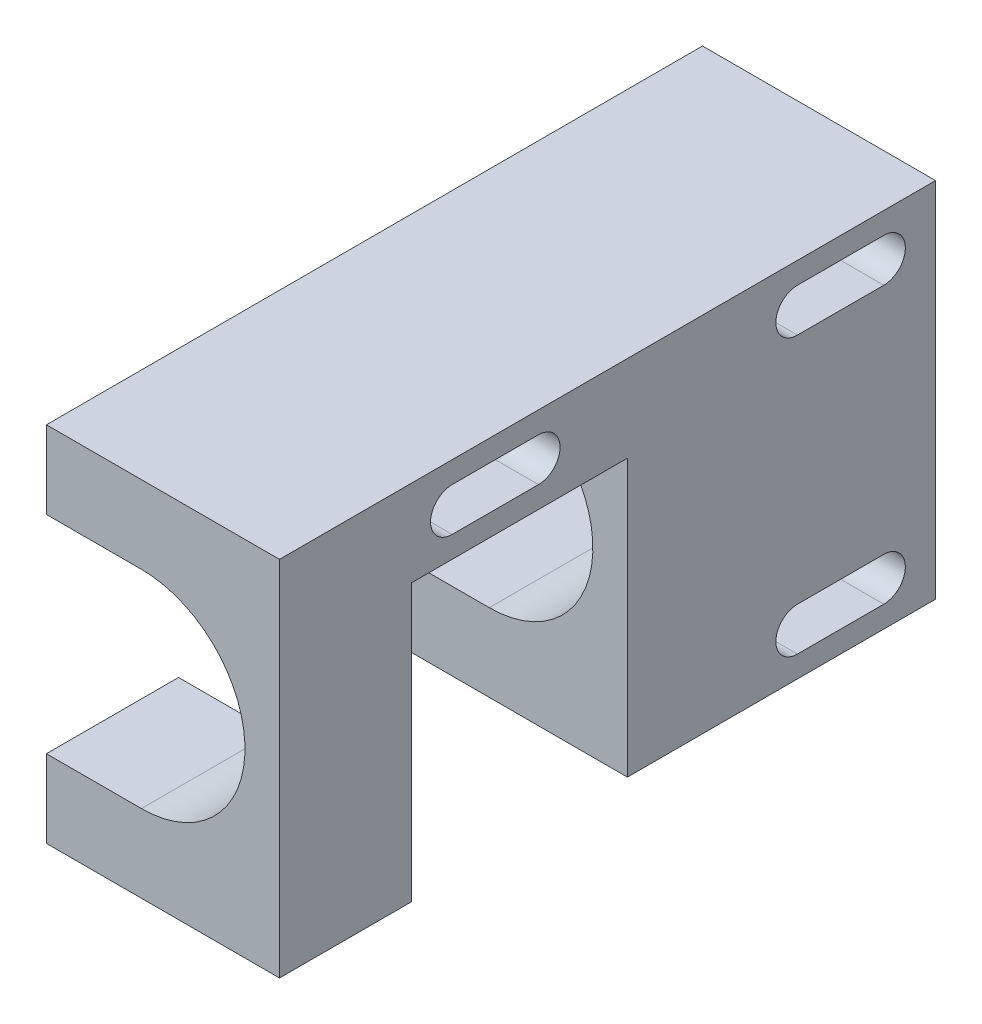
ISO-10303-21;
HEADER;
FILE_DESCRIPTION(('STEP AP214'),'2;1');
FILE_NAME('part.step','',(''),(''),'','','');
FILE_SCHEMA(('AUTOMOTIVE_DESIGN { 1 0 10303 214 1 1 1 1 }'));
ENDSEC;
DATA;
#1=APPLICATION_CONTEXT('core data for automotive mechanical design processes');
#2=APPLICATION_PROTOCOL_DEFINITION('international standard','automotive_design',2000,#1);
#3=PRODUCT_CONTEXT('',#1,'mechanical');
#4=PRODUCT('Part','Part','',(#3));
#5=PRODUCT_RELATED_PRODUCT_CATEGORY('part','',(#4));
#6=PRODUCT_DEFINITION_FORMATION('','',#4);
#7=PRODUCT_DEFINITION_CONTEXT('part definition',#1,'design');
#8=PRODUCT_DEFINITION('design','',#6,#7);
#9=PRODUCT_DEFINITION_SHAPE('','',#8);
#10=(LENGTH_UNIT() NAMED_UNIT(*) SI_UNIT(.MILLI.,.METRE.));
#11=(NAMED_UNIT(*) PLANE_ANGLE_UNIT() SI_UNIT($,.RADIAN.));
#12=(NAMED_UNIT(*) SI_UNIT($,.STERADIAN.) SOLID_ANGLE_UNIT());
#13=UNCERTAINTY_MEASURE_WITH_UNIT(LENGTH_MEASURE(1.E-05),#10,'distance_accuracy_value','');
#14=(GEOMETRIC_REPRESENTATION_CONTEXT(3) GLOBAL_UNCERTAINTY_ASSIGNED_CONTEXT((#13)) GLOBAL_UNIT_ASSIGNED_CONTEXT((#10,
#11,#12)) REPRESENTATION_CONTEXT('',''));
#15=CARTESIAN_POINT('',(0.,0.,0.));
#16=DIRECTION('',(0.,0.,1.));
#17=DIRECTION('',(1.,0.,0.));
#18=AXIS2_PLACEMENT_3D('',#15,#16,#17);
#19=CARTESIAN_POINT('',(0.,0.,76.));
#20=DIRECTION('',(-1.,0.,0.));
#21=DIRECTION('',(0.,-1.,0.));
#22=AXIS2_PLACEMENT_3D('',#19,#20,#21);
#23=PLANE('',#22);
#24=DIRECTION('',(0.,-1.,0.));
#25=VECTOR('',#24,1.);
#26=CARTESIAN_POINT('',(0.,0.,35.7));
#27=LINE('',#26,#25);
#28=CARTESIAN_POINT('',(0.,9.,35.7));
#29=VERTEX_POINT('',#28);
#30=CARTESIAN_POINT('',(0.,0.,35.7));
#31=VERTEX_POINT('',#30);
#32=EDGE_CURVE('E218',#29,#31,#27,.T.);
#33=ORIENTED_EDGE('',*,*,#32,.F.);
#34=DIRECTION('',(0.,0.,-1.));
#35=VECTOR('',#34,1.);
#36=CARTESIAN_POINT('',(0.,9.,76.));
#37=LINE('',#36,#35);
#38=CARTESIAN_POINT('',(0.,9.,0.));
#39=VERTEX_POINT('',#38);
#40=EDGE_CURVE('E273',#29,#39,#37,.T.);
#41=ORIENTED_EDGE('',*,*,#40,.T.);
#42=DIRECTION('',(0.,-1.,0.));
#43=VECTOR('',#42,1.);
#44=CARTESIAN_POINT('',(0.,0.,0.));
#45=LINE('',#44,#43);
#46=CARTESIAN_POINT('',(0.,0.,0.));
#47=VERTEX_POINT('',#46);
#48=EDGE_CURVE('E391',#39,#47,#45,.T.);
#49=ORIENTED_EDGE('',*,*,#48,.T.);
#50=DIRECTION('',(0.,0.,-1.));
#51=VECTOR('',#50,1.);
#52=CARTESIAN_POINT('',(0.,0.,76.));
#53=LINE('',#52,#51);
#54=EDGE_CURVE('E227',#31,#47,#53,.T.);
#55=ORIENTED_EDGE('',*,*,#54,.F.);
#56=EDGE_LOOP('',(#33,#41,#49,#55));
#57=FACE_BOUND('',#56,.T.);
#58=CARTESIAN_POINT('',(0.,5.,16.));
#59=DIRECTION('',(1.,0.,0.));
#60=DIRECTION('',(0.,-1.,0.));
#61=AXIS2_PLACEMENT_3D('',#58,#59,#60);
#62=CIRCLE('',#61,2.49999999999999);
#63=CARTESIAN_POINT('',(0.,7.49999999999999,16.));
#64=VERTEX_POINT('',#63);
#65=CARTESIAN_POINT('',(0.,2.50000000000001,16.));
#66=VERTEX_POINT('',#65);
#67=EDGE_CURVE('E270',#64,#66,#62,.T.);
#68=ORIENTED_EDGE('',*,*,#67,.T.);
#69=DIRECTION('',(0.,0.,-1.));
#70=VECTOR('',#69,1.);
#71=CARTESIAN_POINT('',(0.,2.50000000000001,16.));
#72=LINE('',#71,#70);
#73=CARTESIAN_POINT('',(0.,2.50000000000001,6.));
#74=VERTEX_POINT('',#73);
#75=EDGE_CURVE('E360',#66,#74,#72,.T.);
#76=ORIENTED_EDGE('',*,*,#75,.T.);
#77=CARTESIAN_POINT('',(0.,5.,6.));
#78=DIRECTION('',(1.,0.,0.));
#79=DIRECTION('',(0.,-1.,0.));
#80=AXIS2_PLACEMENT_3D('',#77,#78,#79);
#81=CIRCLE('',#80,2.49999999999999);
#82=CARTESIAN_POINT('',(0.,7.49999999999999,6.));
#83=VERTEX_POINT('',#82);
#84=EDGE_CURVE('E363',#74,#83,#81,.T.);
#85=ORIENTED_EDGE('',*,*,#84,.T.);
#86=DIRECTION('',(0.,0.,1.));
#87=VECTOR('',#86,1.);
#88=CARTESIAN_POINT('',(0.,7.49999999999999,16.));
#89=LINE('',#88,#87);
#90=EDGE_CURVE('E348',#83,#64,#89,.T.);
#91=ORIENTED_EDGE('',*,*,#90,.T.);
#92=EDGE_LOOP('',(#68,#76,#85,#91));
#93=FACE_BOUND('',#92,.T.);
#94=ADVANCED_FACE('F35',(#57,#93),#23,.T.);
#95=CARTESIAN_POINT('',(27.,0.,76.));
#96=DIRECTION('',(0.,-1.,0.));
#97=DIRECTION('',(0.,0.,1.));
#98=AXIS2_PLACEMENT_3D('',#95,#96,#97);
#99=PLANE('',#98);
#100=DIRECTION('',(1.,0.,0.));
#101=VECTOR('',#100,1.);
#102=CARTESIAN_POINT('',(0.,0.,35.7));
#103=LINE('',#102,#101);
#104=CARTESIAN_POINT('',(27.,0.,35.7));
#105=VERTEX_POINT('',#104);
#106=EDGE_CURVE('E243',#31,#105,#103,.T.);
#107=ORIENTED_EDGE('',*,*,#106,.F.);
#108=ORIENTED_EDGE('',*,*,#54,.T.);
#109=DIRECTION('',(1.,0.,0.));
#110=VECTOR('',#109,1.);
#111=CARTESIAN_POINT('',(27.,0.,0.));
#112=LINE('',#111,#110);
#113=CARTESIAN_POINT('',(27.,0.,0.));
#114=VERTEX_POINT('',#113);
#115=EDGE_CURVE('E306',#47,#114,#112,.T.);
#116=ORIENTED_EDGE('',*,*,#115,.T.);
#117=DIRECTION('',(0.,0.,-1.));
#118=VECTOR('',#117,1.);
#119=CARTESIAN_POINT('',(27.,0.,76.));
#120=LINE('',#119,#118);
#121=EDGE_CURVE('E384',#105,#114,#120,.T.);
#122=ORIENTED_EDGE('',*,*,#121,.F.);
#123=EDGE_LOOP('',(#107,#108,#116,#122));
#124=FACE_BOUND('',#123,.T.);
#125=ADVANCED_FACE('F420',(#124),#99,.T.);
#126=CARTESIAN_POINT('',(0.,9.,76.));
#127=DIRECTION('',(0.,-1.,0.));
#128=DIRECTION('',(0.,0.,1.));
#129=AXIS2_PLACEMENT_3D('',#126,#127,#128);
#130=PLANE('',#129);
#131=DIRECTION('',(0.,0.,-1.));
#132=VECTOR('',#131,1.);
#133=CARTESIAN_POINT('',(11.,9.,76.));
#134=LINE('',#133,#132);
#135=CARTESIAN_POINT('',(11.,9.,35.7));
#136=VERTEX_POINT('',#135);
#137=CARTESIAN_POINT('',(11.,9.,0.));
#138=VERTEX_POINT('',#137);
#139=EDGE_CURVE('E271',#136,#138,#134,.T.);
#140=ORIENTED_EDGE('',*,*,#139,.T.);
#141=DIRECTION('',(1.,0.,0.));
#142=VECTOR('',#141,1.);
#143=CARTESIAN_POINT('',(0.,9.,0.));
#144=LINE('',#143,#142);
#145=EDGE_CURVE('E257',#39,#138,#144,.T.);
#146=ORIENTED_EDGE('',*,*,#145,.F.);
#147=ORIENTED_EDGE('',*,*,#40,.F.);
#148=DIRECTION('',(-1.,0.,0.));
#149=VECTOR('',#148,1.);
#150=CARTESIAN_POINT('',(0.,9.,35.7));
#151=LINE('',#150,#149);
#152=EDGE_CURVE('E43',#136,#29,#151,.T.);
#153=ORIENTED_EDGE('',*,*,#152,.F.);
#154=EDGE_LOOP('',(#140,#146,#147,#153));
#155=FACE_BOUND('',#154,.T.);
#156=ADVANCED_FACE('F412',(#155),#130,.F.);
#157=DIRECTION('',(0.,1.,0.));
#158=VECTOR('',#157,1.);
#159=CARTESIAN_POINT('',(0.,32.,60.7));
#160=LINE('',#159,#158);
#161=CARTESIAN_POINT('',(0.,0.,60.7));
#162=VERTEX_POINT('',#161);
#163=CARTESIAN_POINT('',(0.,9.,60.7));
#164=VERTEX_POINT('',#163);
#165=EDGE_CURVE('E211',#162,#164,#160,.T.);
#166=ORIENTED_EDGE('',*,*,#165,.F.);
#167=CARTESIAN_POINT('',(0.,0.,76.));
#168=VERTEX_POINT('',#167);
#169=EDGE_CURVE('E221',#168,#162,#53,.T.);
#170=ORIENTED_EDGE('',*,*,#169,.F.);
#171=DIRECTION('',(0.,-1.,0.));
#172=VECTOR('',#171,1.);
#173=CARTESIAN_POINT('',(0.,0.,76.));
#174=LINE('',#173,#172);
#175=CARTESIAN_POINT('',(0.,9.,76.));
#176=VERTEX_POINT('',#175);
#177=EDGE_CURVE('E380',#176,#168,#174,.T.);
#178=ORIENTED_EDGE('',*,*,#177,.F.);
#179=EDGE_CURVE('E232',#176,#164,#37,.T.);
#180=ORIENTED_EDGE('',*,*,#179,.T.);
#181=EDGE_LOOP('',(#166,#170,#178,#180));
#182=FACE_BOUND('',#181,.T.);
#183=ADVANCED_FACE('F230',(#182),#23,.T.);
#184=DIRECTION('',(1.,0.,0.));
#185=VECTOR('',#184,1.);
#186=CARTESIAN_POINT('',(0.,0.,60.7));
#187=LINE('',#186,#185);
#188=CARTESIAN_POINT('',(27.,0.,60.7));
#189=VERTEX_POINT('',#188);
#190=EDGE_CURVE('E207',#162,#189,#187,.T.);
#191=ORIENTED_EDGE('',*,*,#190,.T.);
#192=CARTESIAN_POINT('',(27.,0.,76.));
#193=VERTEX_POINT('',#192);
#194=EDGE_CURVE('E400',#193,#189,#120,.T.);
#195=ORIENTED_EDGE('',*,*,#194,.F.);
#196=DIRECTION('',(1.,0.,0.));
#197=VECTOR('',#196,1.);
#198=CARTESIAN_POINT('',(27.,0.,76.));
#199=LINE('',#198,#197);
#200=EDGE_CURVE('E223',#168,#193,#199,.T.);
#201=ORIENTED_EDGE('',*,*,#200,.F.);
#202=ORIENTED_EDGE('',*,*,#169,.T.);
#203=EDGE_LOOP('',(#191,#195,#201,#202));
#204=FACE_BOUND('',#203,.T.);
#205=ADVANCED_FACE('F37',(#204),#99,.T.);
#206=DIRECTION('',(0.,0.,-1.));
#207=VECTOR('',#206,1.);
#208=CARTESIAN_POINT('',(0.,33.,76.));
#209=LINE('',#208,#207);
#210=CARTESIAN_POINT('',(0.,33.,76.));
#211=VERTEX_POINT('',#210);
#212=CARTESIAN_POINT('',(0.,33.,0.));
#213=VERTEX_POINT('',#212);
#214=EDGE_CURVE('E274',#211,#213,#209,.T.);
#215=ORIENTED_EDGE('',*,*,#214,.F.);
#216=CARTESIAN_POINT('',(0.,42.,76.));
#217=VERTEX_POINT('',#216);
#218=EDGE_CURVE('E381',#217,#211,#174,.T.);
#219=ORIENTED_EDGE('',*,*,#218,.F.);
#220=DIRECTION('',(0.,0.,-1.));
#221=VECTOR('',#220,1.);
#222=CARTESIAN_POINT('',(0.,42.,76.));
#223=LINE('',#222,#221);
#224=CARTESIAN_POINT('',(0.,42.,0.));
#225=VERTEX_POINT('',#224);
#226=EDGE_CURVE('E394',#217,#225,#223,.T.);
#227=ORIENTED_EDGE('',*,*,#226,.T.);
#228=EDGE_CURVE('E376',#225,#213,#45,.T.);
#229=ORIENTED_EDGE('',*,*,#228,.T.);
#230=EDGE_LOOP('',(#215,#219,#227,#229));
#231=FACE_BOUND('',#230,.T.);
#232=CARTESIAN_POINT('',(0.,37.,56.));
#233=DIRECTION('',(1.,0.,0.));
#234=DIRECTION('',(0.,-1.,0.));
#235=AXIS2_PLACEMENT_3D('',#232,#233,#234);
#236=CIRCLE('',#235,2.5);
#237=CARTESIAN_POINT('',(0.,39.5,56.));
#238=VERTEX_POINT('',#237);
#239=CARTESIAN_POINT('',(0.,34.5,56.));
#240=VERTEX_POINT('',#239);
#241=EDGE_CURVE('E292',#238,#240,#236,.T.);
#242=ORIENTED_EDGE('',*,*,#241,.T.);
#243=DIRECTION('',(0.,0.,-1.));
#244=VECTOR('',#243,1.);
#245=CARTESIAN_POINT('',(0.,34.5,56.));
#246=LINE('',#245,#244);
#247=CARTESIAN_POINT('',(0.,34.5,46.));
#248=VERTEX_POINT('',#247);
#249=EDGE_CURVE('E295',#240,#248,#246,.T.);
#250=ORIENTED_EDGE('',*,*,#249,.T.);
#251=CARTESIAN_POINT('',(0.,37.,46.));
#252=DIRECTION('',(1.,0.,0.));
#253=DIRECTION('',(0.,-1.,0.));
#254=AXIS2_PLACEMENT_3D('',#251,#252,#253);
#255=CIRCLE('',#254,2.5);
#256=CARTESIAN_POINT('',(0.,39.5,46.));
#257=VERTEX_POINT('',#256);
#258=EDGE_CURVE('E299',#248,#257,#255,.T.);
#259=ORIENTED_EDGE('',*,*,#258,.T.);
#260=DIRECTION('',(0.,0.,1.));
#261=VECTOR('',#260,1.);
#262=CARTESIAN_POINT('',(0.,39.5,56.));
#263=LINE('',#262,#261);
#264=EDGE_CURVE('E282',#257,#238,#263,.T.);
#265=ORIENTED_EDGE('',*,*,#264,.T.);
#266=EDGE_LOOP('',(#242,#250,#259,#265));
#267=FACE_BOUND('',#266,.T.);
#268=CARTESIAN_POINT('',(0.,37.,16.));
#269=DIRECTION('',(1.,0.,0.));
#270=DIRECTION('',(0.,-1.,0.));
#271=AXIS2_PLACEMENT_3D('',#268,#269,#270);
#272=CIRCLE('',#271,2.5);
#273=CARTESIAN_POINT('',(0.,39.5,16.));
#274=VERTEX_POINT('',#273);
#275=CARTESIAN_POINT('',(0.,34.5,16.));
#276=VERTEX_POINT('',#275);
#277=EDGE_CURVE('E326',#274,#276,#272,.T.);
#278=ORIENTED_EDGE('',*,*,#277,.T.);
#279=DIRECTION('',(0.,0.,-1.));
#280=VECTOR('',#279,1.);
#281=CARTESIAN_POINT('',(0.,34.5,16.));
#282=LINE('',#281,#280);
#283=CARTESIAN_POINT('',(0.,34.5,6.00000000000001));
#284=VERTEX_POINT('',#283);
#285=EDGE_CURVE('E329',#276,#284,#282,.T.);
#286=ORIENTED_EDGE('',*,*,#285,.T.);
#287=CARTESIAN_POINT('',(0.,37.,6.00000000000001));
#288=DIRECTION('',(1.,0.,0.));
#289=DIRECTION('',(0.,-1.,0.));
#290=AXIS2_PLACEMENT_3D('',#287,#288,#289);
#291=CIRCLE('',#290,2.5);
#292=CARTESIAN_POINT('',(0.,39.5,6.00000000000001));
#293=VERTEX_POINT('',#292);
#294=EDGE_CURVE('E333',#284,#293,#291,.T.);
#295=ORIENTED_EDGE('',*,*,#294,.T.);
#296=DIRECTION('',(0.,0.,1.));
#297=VECTOR('',#296,1.);
#298=CARTESIAN_POINT('',(0.,39.5,16.));
#299=LINE('',#298,#297);
#300=EDGE_CURVE('E316',#293,#274,#299,.T.);
#301=ORIENTED_EDGE('',*,*,#300,.T.);
#302=EDGE_LOOP('',(#278,#286,#295,#301));
#303=FACE_BOUND('',#302,.T.);
#304=ADVANCED_FACE('F453',(#231,#267,#303),#23,.T.);
#305=CARTESIAN_POINT('',(0.,42.,76.));
#306=DIRECTION('',(0.,1.,0.));
#307=DIRECTION('',(0.,0.,-1.));
#308=AXIS2_PLACEMENT_3D('',#305,#306,#307);
#309=PLANE('',#308);
#310=DIRECTION('',(-1.,0.,0.));
#311=VECTOR('',#310,1.);
#312=CARTESIAN_POINT('',(0.,42.,0.));
#313=LINE('',#312,#311);
#314=CARTESIAN_POINT('',(27.,42.,0.));
#315=VERTEX_POINT('',#314);
#316=EDGE_CURVE('E389',#315,#225,#313,.T.);
#317=ORIENTED_EDGE('',*,*,#316,.T.);
#318=ORIENTED_EDGE('',*,*,#226,.F.);
#319=DIRECTION('',(-1.,0.,0.));
#320=VECTOR('',#319,1.);
#321=CARTESIAN_POINT('',(0.,42.,76.));
#322=LINE('',#321,#320);
#323=CARTESIAN_POINT('',(27.,42.,76.));
#324=VERTEX_POINT('',#323);
#325=EDGE_CURVE('E378',#324,#217,#322,.T.);
#326=ORIENTED_EDGE('',*,*,#325,.F.);
#327=DIRECTION('',(0.,0.,-1.));
#328=VECTOR('',#327,1.);
#329=CARTESIAN_POINT('',(27.,42.,76.));
#330=LINE('',#329,#328);
#331=EDGE_CURVE('E397',#324,#315,#330,.T.);
#332=ORIENTED_EDGE('',*,*,#331,.T.);
#333=EDGE_LOOP('',(#317,#318,#326,#332));
#334=FACE_BOUND('',#333,.T.);
#335=ADVANCED_FACE('F440',(#334),#309,.T.);
#336=CARTESIAN_POINT('',(27.,42.,76.));
#337=DIRECTION('',(1.,0.,0.));
#338=DIRECTION('',(0.,1.,0.));
#339=AXIS2_PLACEMENT_3D('',#336,#337,#338);
#340=PLANE('',#339);
#341=DIRECTION('',(0.,-1.,0.));
#342=VECTOR('',#341,1.);
#343=CARTESIAN_POINT('',(27.,0.,35.7));
#344=LINE('',#343,#342);
#345=CARTESIAN_POINT('',(27.,32.,35.7));
#346=VERTEX_POINT('',#345);
#347=EDGE_CURVE('E233',#346,#105,#344,.T.);
#348=ORIENTED_EDGE('',*,*,#347,.T.);
#349=ORIENTED_EDGE('',*,*,#121,.T.);
#350=DIRECTION('',(0.,1.,0.));
#351=VECTOR('',#350,1.);
#352=CARTESIAN_POINT('',(27.,42.,0.));
#353=LINE('',#352,#351);
#354=EDGE_CURVE('E387',#114,#315,#353,.T.);
#355=ORIENTED_EDGE('',*,*,#354,.T.);
#356=ORIENTED_EDGE('',*,*,#331,.F.);
#357=DIRECTION('',(0.,1.,0.));
#358=VECTOR('',#357,1.);
#359=CARTESIAN_POINT('',(27.,42.,76.));
#360=LINE('',#359,#358);
#361=EDGE_CURVE('E375',#193,#324,#360,.T.);
#362=ORIENTED_EDGE('',*,*,#361,.F.);
#363=ORIENTED_EDGE('',*,*,#194,.T.);
#364=DIRECTION('',(0.,1.,0.));
#365=VECTOR('',#364,1.);
#366=CARTESIAN_POINT('',(27.,32.,60.7));
#367=LINE('',#366,#365);
#368=CARTESIAN_POINT('',(27.,32.,60.7));
#369=VERTEX_POINT('',#368);
#370=EDGE_CURVE('E213',#189,#369,#367,.T.);
#371=ORIENTED_EDGE('',*,*,#370,.T.);
#372=DIRECTION('',(0.,0.,-1.));
#373=VECTOR('',#372,1.);
#374=CARTESIAN_POINT('',(27.,32.,35.7));
#375=LINE('',#374,#373);
#376=EDGE_CURVE('E237',#369,#346,#375,.T.);
#377=ORIENTED_EDGE('',*,*,#376,.T.);
#378=EDGE_LOOP('',(#348,#349,#355,#356,#362,#363,#371,#377));
#379=FACE_BOUND('',#378,.T.);
#380=CARTESIAN_POINT('',(27.,37.,56.));
#381=DIRECTION('',(1.,0.,0.));
#382=DIRECTION('',(0.,-1.,0.));
#383=AXIS2_PLACEMENT_3D('',#380,#381,#382);
#384=CIRCLE('',#383,2.5);
#385=CARTESIAN_POINT('',(27.,39.5,56.));
#386=VERTEX_POINT('',#385);
#387=CARTESIAN_POINT('',(27.,34.5,56.));
#388=VERTEX_POINT('',#387);
#389=EDGE_CURVE('E278',#386,#388,#384,.T.);
#390=ORIENTED_EDGE('',*,*,#389,.F.);
#391=DIRECTION('',(0.,0.,1.));
#392=VECTOR('',#391,1.);
#393=CARTESIAN_POINT('',(27.,39.5,56.));
#394=LINE('',#393,#392);
#395=CARTESIAN_POINT('',(27.,39.5,46.));
#396=VERTEX_POINT('',#395);
#397=EDGE_CURVE('E288',#396,#386,#394,.T.);
#398=ORIENTED_EDGE('',*,*,#397,.F.);
#399=CARTESIAN_POINT('',(27.,37.,46.));
#400=DIRECTION('',(1.,0.,0.));
#401=DIRECTION('',(0.,-1.,0.));
#402=AXIS2_PLACEMENT_3D('',#399,#400,#401);
#403=CIRCLE('',#402,2.5);
#404=CARTESIAN_POINT('',(27.,34.5,46.));
#405=VERTEX_POINT('',#404);
#406=EDGE_CURVE('E285',#405,#396,#403,.T.);
#407=ORIENTED_EDGE('',*,*,#406,.F.);
#408=DIRECTION('',(0.,0.,-1.));
#409=VECTOR('',#408,1.);
#410=CARTESIAN_POINT('',(27.,34.5,56.));
#411=LINE('',#410,#409);
#412=EDGE_CURVE('E281',#388,#405,#411,.T.);
#413=ORIENTED_EDGE('',*,*,#412,.F.);
#414=EDGE_LOOP('',(#390,#398,#407,#413));
#415=FACE_BOUND('',#414,.T.);
#416=CARTESIAN_POINT('',(27.,37.,16.));
#417=DIRECTION('',(1.,0.,0.));
#418=DIRECTION('',(0.,-1.,0.));
#419=AXIS2_PLACEMENT_3D('',#416,#417,#418);
#420=CIRCLE('',#419,2.5);
#421=CARTESIAN_POINT('',(27.,39.5,16.));
#422=VERTEX_POINT('',#421);
#423=CARTESIAN_POINT('',(27.,34.5,16.));
#424=VERTEX_POINT('',#423);
#425=EDGE_CURVE('E312',#422,#424,#420,.T.);
#426=ORIENTED_EDGE('',*,*,#425,.F.);
#427=DIRECTION('',(0.,0.,1.));
#428=VECTOR('',#427,1.);
#429=CARTESIAN_POINT('',(27.,39.5,16.));
#430=LINE('',#429,#428);
#431=CARTESIAN_POINT('',(27.,39.5,6.00000000000001));
#432=VERTEX_POINT('',#431);
#433=EDGE_CURVE('E322',#432,#422,#430,.T.);
#434=ORIENTED_EDGE('',*,*,#433,.F.);
#435=CARTESIAN_POINT('',(27.,37.,6.00000000000001));
#436=DIRECTION('',(1.,0.,0.));
#437=DIRECTION('',(0.,-1.,0.));
#438=AXIS2_PLACEMENT_3D('',#435,#436,#437);
#439=CIRCLE('',#438,2.5);
#440=CARTESIAN_POINT('',(27.,34.5,6.00000000000001));
#441=VERTEX_POINT('',#440);
#442=EDGE_CURVE('E319',#441,#432,#439,.T.);
#443=ORIENTED_EDGE('',*,*,#442,.F.);
#444=DIRECTION('',(0.,0.,-1.));
#445=VECTOR('',#444,1.);
#446=CARTESIAN_POINT('',(27.,34.5,16.));
#447=LINE('',#446,#445);
#448=EDGE_CURVE('E315',#424,#441,#447,.T.);
#449=ORIENTED_EDGE('',*,*,#448,.F.);
#450=EDGE_LOOP('',(#426,#434,#443,#449));
#451=FACE_BOUND('',#450,.T.);
#452=CARTESIAN_POINT('',(27.,5.,16.));
#453=DIRECTION('',(1.,0.,0.));
#454=DIRECTION('',(0.,-1.,0.));
#455=AXIS2_PLACEMENT_3D('',#452,#453,#454);
#456=CIRCLE('',#455,2.49999999999999);
#457=CARTESIAN_POINT('',(27.,7.49999999999999,16.));
#458=VERTEX_POINT('',#457);
#459=CARTESIAN_POINT('',(27.,2.50000000000002,16.));
#460=VERTEX_POINT('',#459);
#461=EDGE_CURVE('E344',#458,#460,#456,.T.);
#462=ORIENTED_EDGE('',*,*,#461,.F.);
#463=DIRECTION('',(0.,0.,1.));
#464=VECTOR('',#463,1.);
#465=CARTESIAN_POINT('',(27.,7.49999999999999,16.));
#466=LINE('',#465,#464);
#467=CARTESIAN_POINT('',(27.,7.49999999999999,6.));
#468=VERTEX_POINT('',#467);
#469=EDGE_CURVE('E354',#468,#458,#466,.T.);
#470=ORIENTED_EDGE('',*,*,#469,.F.);
#471=CARTESIAN_POINT('',(27.,5.,6.));
#472=DIRECTION('',(1.,0.,0.));
#473=DIRECTION('',(0.,-1.,0.));
#474=AXIS2_PLACEMENT_3D('',#471,#472,#473);
#475=CIRCLE('',#474,2.49999999999999);
#476=CARTESIAN_POINT('',(27.,2.50000000000002,6.00000000000001));
#477=VERTEX_POINT('',#476);
#478=EDGE_CURVE('E351',#477,#468,#475,.T.);
#479=ORIENTED_EDGE('',*,*,#478,.F.);
#480=DIRECTION('',(0.,0.,-1.));
#481=VECTOR('',#480,1.);
#482=CARTESIAN_POINT('',(27.,2.50000000000002,16.));
#483=LINE('',#482,#481);
#484=EDGE_CURVE('E347',#460,#477,#483,.T.);
#485=ORIENTED_EDGE('',*,*,#484,.F.);
#486=EDGE_LOOP('',(#462,#470,#479,#485));
#487=FACE_BOUND('',#486,.T.);
#488=ADVANCED_FACE('F425',(#379,#415,#451,#487),#340,.T.);
#489=CARTESIAN_POINT('',(0.,0.,76.));
#490=DIRECTION('',(0.,0.,1.));
#491=DIRECTION('',(-1.,0.,0.));
#492=AXIS2_PLACEMENT_3D('',#489,#490,#491);
#493=PLANE('',#492);
#494=DIRECTION('',(1.,0.,0.));
#495=VECTOR('',#494,1.);
#496=CARTESIAN_POINT('',(0.,9.,76.));
#497=LINE('',#496,#495);
#498=CARTESIAN_POINT('',(11.,9.,76.));
#499=VERTEX_POINT('',#498);
#500=EDGE_CURVE('E259',#176,#499,#497,.T.);
#501=ORIENTED_EDGE('',*,*,#500,.F.);
#502=ORIENTED_EDGE('',*,*,#177,.T.);
#503=ORIENTED_EDGE('',*,*,#200,.T.);
#504=ORIENTED_EDGE('',*,*,#361,.T.);
#505=ORIENTED_EDGE('',*,*,#325,.T.);
#506=ORIENTED_EDGE('',*,*,#218,.T.);
#507=DIRECTION('',(-1.,0.,0.));
#508=VECTOR('',#507,1.);
#509=CARTESIAN_POINT('',(11.,33.,76.));
#510=LINE('',#509,#508);
#511=CARTESIAN_POINT('',(11.,33.,76.));
#512=VERTEX_POINT('',#511);
#513=EDGE_CURVE('E256',#512,#211,#510,.T.);
#514=ORIENTED_EDGE('',*,*,#513,.F.);
#515=CARTESIAN_POINT('',(11.,21.,76.));
#516=DIRECTION('',(0.,0.,1.));
#517=DIRECTION('',(-1.,0.,0.));
#518=AXIS2_PLACEMENT_3D('',#515,#516,#517);
#519=CIRCLE('',#518,12.);
#520=EDGE_CURVE('E254',#499,#512,#519,.T.);
#521=ORIENTED_EDGE('',*,*,#520,.F.);
#522=EDGE_LOOP('',(#501,#502,#503,#504,#505,#506,#514,#521));
#523=FACE_BOUND('',#522,.T.);
#524=ADVANCED_FACE('F444',(#523),#493,.T.);
#525=CARTESIAN_POINT('',(0.,0.,0.));
#526=DIRECTION('',(0.,0.,1.));
#527=DIRECTION('',(-1.,0.,0.));
#528=AXIS2_PLACEMENT_3D('',#525,#526,#527);
#529=PLANE('',#528);
#530=CARTESIAN_POINT('',(11.,21.,0.));
#531=DIRECTION('',(0.,0.,1.));
#532=DIRECTION('',(-1.,0.,0.));
#533=AXIS2_PLACEMENT_3D('',#530,#531,#532);
#534=CIRCLE('',#533,12.);
#535=CARTESIAN_POINT('',(11.,33.,0.));
#536=VERTEX_POINT('',#535);
#537=EDGE_CURVE('E253',#138,#536,#534,.T.);
#538=ORIENTED_EDGE('',*,*,#537,.T.);
#539=DIRECTION('',(-1.,0.,0.));
#540=VECTOR('',#539,1.);
#541=CARTESIAN_POINT('',(11.,33.,0.));
#542=LINE('',#541,#540);
#543=EDGE_CURVE('E264',#536,#213,#542,.T.);
#544=ORIENTED_EDGE('',*,*,#543,.T.);
#545=ORIENTED_EDGE('',*,*,#228,.F.);
#546=ORIENTED_EDGE('',*,*,#316,.F.);
#547=ORIENTED_EDGE('',*,*,#354,.F.);
#548=ORIENTED_EDGE('',*,*,#115,.F.);
#549=ORIENTED_EDGE('',*,*,#48,.F.);
#550=ORIENTED_EDGE('',*,*,#145,.T.);
#551=EDGE_LOOP('',(#538,#544,#545,#546,#547,#548,#549,#550));
#552=FACE_BOUND('',#551,.T.);
#553=ADVANCED_FACE('F434',(#552),#529,.F.);
#554=CARTESIAN_POINT('',(27.,5.,16.));
#555=DIRECTION('',(-1.,0.,0.));
#556=DIRECTION('',(0.,-1.,0.));
#557=AXIS2_PLACEMENT_3D('',#554,#555,#556);
#558=CYLINDRICAL_SURFACE('',#557,2.49999999999999);
#559=ORIENTED_EDGE('',*,*,#67,.F.);
#560=DIRECTION('',(-1.,0.,0.));
#561=VECTOR('',#560,1.);
#562=CARTESIAN_POINT('',(27.,7.49999999999999,16.));
#563=LINE('',#562,#561);
#564=EDGE_CURVE('E330',#458,#64,#563,.T.);
#565=ORIENTED_EDGE('',*,*,#564,.F.);
#566=ORIENTED_EDGE('',*,*,#461,.T.);
#567=DIRECTION('',(-1.,0.,0.));
#568=VECTOR('',#567,1.);
#569=CARTESIAN_POINT('',(27.,2.50000000000002,16.));
#570=LINE('',#569,#568);
#571=EDGE_CURVE('E357',#460,#66,#570,.T.);
#572=ORIENTED_EDGE('',*,*,#571,.T.);
#573=EDGE_LOOP('',(#559,#565,#566,#572));
#574=FACE_BOUND('',#573,.T.);
#575=ADVANCED_FACE('F484',(#574),#558,.F.);
#576=CARTESIAN_POINT('',(27.,7.49999999999999,16.));
#577=DIRECTION('',(0.,1.,0.));
#578=DIRECTION('',(-1.,0.,0.));
#579=AXIS2_PLACEMENT_3D('',#576,#577,#578);
#580=PLANE('',#579);
#581=ORIENTED_EDGE('',*,*,#90,.F.);
#582=DIRECTION('',(-1.,0.,0.));
#583=VECTOR('',#582,1.);
#584=CARTESIAN_POINT('',(27.,7.49999999999999,6.));
#585=LINE('',#584,#583);
#586=EDGE_CURVE('E369',#468,#83,#585,.T.);
#587=ORIENTED_EDGE('',*,*,#586,.F.);
#588=ORIENTED_EDGE('',*,*,#469,.T.);
#589=ORIENTED_EDGE('',*,*,#564,.T.);
#590=EDGE_LOOP('',(#581,#587,#588,#589));
#591=FACE_BOUND('',#590,.T.);
#592=ADVANCED_FACE('F488',(#591),#580,.F.);
#593=CARTESIAN_POINT('',(27.,5.,6.));
#594=DIRECTION('',(-1.,0.,0.));
#595=DIRECTION('',(0.,-1.,0.));
#596=AXIS2_PLACEMENT_3D('',#593,#594,#595);
#597=CYLINDRICAL_SURFACE('',#596,2.49999999999999);
#598=ORIENTED_EDGE('',*,*,#84,.F.);
#599=DIRECTION('',(-1.,0.,0.));
#600=VECTOR('',#599,1.);
#601=CARTESIAN_POINT('',(27.,2.50000000000002,6.));
#602=LINE('',#601,#600);
#603=EDGE_CURVE('E371',#477,#74,#602,.T.);
#604=ORIENTED_EDGE('',*,*,#603,.F.);
#605=ORIENTED_EDGE('',*,*,#478,.T.);
#606=ORIENTED_EDGE('',*,*,#586,.T.);
#607=EDGE_LOOP('',(#598,#604,#605,#606));
#608=FACE_BOUND('',#607,.T.);
#609=ADVANCED_FACE('F491',(#608),#597,.F.);
#610=CARTESIAN_POINT('',(27.,2.50000000000002,16.));
#611=DIRECTION('',(0.,-1.,0.));
#612=DIRECTION('',(1.,0.,0.));
#613=AXIS2_PLACEMENT_3D('',#610,#611,#612);
#614=PLANE('',#613);
#615=ORIENTED_EDGE('',*,*,#75,.F.);
#616=ORIENTED_EDGE('',*,*,#571,.F.);
#617=ORIENTED_EDGE('',*,*,#484,.T.);
#618=ORIENTED_EDGE('',*,*,#603,.T.);
#619=EDGE_LOOP('',(#615,#616,#617,#618));
#620=FACE_BOUND('',#619,.T.);
#621=ADVANCED_FACE('F493',(#620),#614,.F.);
#622=CARTESIAN_POINT('',(27.,37.,16.));
#623=DIRECTION('',(-1.,0.,0.));
#624=DIRECTION('',(0.,-1.,0.));
#625=AXIS2_PLACEMENT_3D('',#622,#623,#624);
#626=CYLINDRICAL_SURFACE('',#625,2.5);
#627=ORIENTED_EDGE('',*,*,#277,.F.);
#628=DIRECTION('',(-1.,0.,0.));
#629=VECTOR('',#628,1.);
#630=CARTESIAN_POINT('',(27.,39.5,16.));
#631=LINE('',#630,#629);
#632=EDGE_CURVE('E296',#422,#274,#631,.T.);
#633=ORIENTED_EDGE('',*,*,#632,.F.);
#634=ORIENTED_EDGE('',*,*,#425,.T.);
#635=DIRECTION('',(-1.,0.,0.));
#636=VECTOR('',#635,1.);
#637=CARTESIAN_POINT('',(27.,34.5,16.));
#638=LINE('',#637,#636);
#639=EDGE_CURVE('E325',#424,#276,#638,.T.);
#640=ORIENTED_EDGE('',*,*,#639,.T.);
#641=EDGE_LOOP('',(#627,#633,#634,#640));
#642=FACE_BOUND('',#641,.T.);
#643=ADVANCED_FACE('F463',(#642),#626,.F.);
#644=CARTESIAN_POINT('',(27.,39.5,16.));
#645=DIRECTION('',(0.,1.,0.));
#646=DIRECTION('',(-1.,0.,0.));
#647=AXIS2_PLACEMENT_3D('',#644,#645,#646);
#648=PLANE('',#647);
#649=ORIENTED_EDGE('',*,*,#300,.F.);
#650=DIRECTION('',(-1.,0.,0.));
#651=VECTOR('',#650,1.);
#652=CARTESIAN_POINT('',(27.,39.5,6.00000000000001));
#653=LINE('',#652,#651);
#654=EDGE_CURVE('E339',#432,#293,#653,.T.);
#655=ORIENTED_EDGE('',*,*,#654,.F.);
#656=ORIENTED_EDGE('',*,*,#433,.T.);
#657=ORIENTED_EDGE('',*,*,#632,.T.);
#658=EDGE_LOOP('',(#649,#655,#656,#657));
#659=FACE_BOUND('',#658,.T.);
#660=ADVANCED_FACE('F474',(#659),#648,.F.);
#661=CARTESIAN_POINT('',(27.,37.,6.00000000000001));
#662=DIRECTION('',(-1.,0.,0.));
#663=DIRECTION('',(0.,-1.,0.));
#664=AXIS2_PLACEMENT_3D('',#661,#662,#663);
#665=CYLINDRICAL_SURFACE('',#664,2.5);
#666=ORIENTED_EDGE('',*,*,#294,.F.);
#667=DIRECTION('',(-1.,0.,0.));
#668=VECTOR('',#667,1.);
#669=CARTESIAN_POINT('',(27.,34.5,6.00000000000001));
#670=LINE('',#669,#668);
#671=EDGE_CURVE('E341',#441,#284,#670,.T.);
#672=ORIENTED_EDGE('',*,*,#671,.F.);
#673=ORIENTED_EDGE('',*,*,#442,.T.);
#674=ORIENTED_EDGE('',*,*,#654,.T.);
#675=EDGE_LOOP('',(#666,#672,#673,#674));
#676=FACE_BOUND('',#675,.T.);
#677=ADVANCED_FACE('F471',(#676),#665,.F.);
#678=CARTESIAN_POINT('',(27.,34.5,16.));
#679=DIRECTION('',(0.,-1.,0.));
#680=DIRECTION('',(1.,0.,0.));
#681=AXIS2_PLACEMENT_3D('',#678,#679,#680);
#682=PLANE('',#681);
#683=ORIENTED_EDGE('',*,*,#285,.F.);
#684=ORIENTED_EDGE('',*,*,#639,.F.);
#685=ORIENTED_EDGE('',*,*,#448,.T.);
#686=ORIENTED_EDGE('',*,*,#671,.T.);
#687=EDGE_LOOP('',(#683,#684,#685,#686));
#688=FACE_BOUND('',#687,.T.);
#689=ADVANCED_FACE('F467',(#688),#682,.F.);
#690=CARTESIAN_POINT('',(27.,37.,56.));
#691=DIRECTION('',(-1.,0.,0.));
#692=DIRECTION('',(0.,-1.,0.));
#693=AXIS2_PLACEMENT_3D('',#690,#691,#692);
#694=CYLINDRICAL_SURFACE('',#693,2.5);
#695=ORIENTED_EDGE('',*,*,#241,.F.);
#696=DIRECTION('',(-1.,0.,0.));
#697=VECTOR('',#696,1.);
#698=CARTESIAN_POINT('',(27.,39.5,56.));
#699=LINE('',#698,#697);
#700=EDGE_CURVE('E304',#386,#238,#699,.T.);
#701=ORIENTED_EDGE('',*,*,#700,.F.);
#702=ORIENTED_EDGE('',*,*,#389,.T.);
#703=DIRECTION('',(-1.,0.,0.));
#704=VECTOR('',#703,1.);
#705=CARTESIAN_POINT('',(27.,34.5,56.));
#706=LINE('',#705,#704);
#707=EDGE_CURVE('E291',#388,#240,#706,.T.);
#708=ORIENTED_EDGE('',*,*,#707,.T.);
#709=EDGE_LOOP('',(#695,#701,#702,#708));
#710=FACE_BOUND('',#709,.T.);
#711=ADVANCED_FACE('F527',(#710),#694,.F.);
#712=CARTESIAN_POINT('',(27.,39.5,56.));
#713=DIRECTION('',(0.,1.,0.));
#714=DIRECTION('',(0.,0.,-1.));
#715=AXIS2_PLACEMENT_3D('',#712,#713,#714);
#716=PLANE('',#715);
#717=ORIENTED_EDGE('',*,*,#264,.F.);
#718=DIRECTION('',(-1.,0.,0.));
#719=VECTOR('',#718,1.);
#720=CARTESIAN_POINT('',(27.,39.5,46.));
#721=LINE('',#720,#719);
#722=EDGE_CURVE('E307',#396,#257,#721,.T.);
#723=ORIENTED_EDGE('',*,*,#722,.F.);
#724=ORIENTED_EDGE('',*,*,#397,.T.);
#725=ORIENTED_EDGE('',*,*,#700,.T.);
#726=EDGE_LOOP('',(#717,#723,#724,#725));
#727=FACE_BOUND('',#726,.T.);
#728=ADVANCED_FACE('F524',(#727),#716,.F.);
#729=CARTESIAN_POINT('',(27.,37.,46.));
#730=DIRECTION('',(-1.,0.,0.));
#731=DIRECTION('',(0.,-1.,0.));
#732=AXIS2_PLACEMENT_3D('',#729,#730,#731);
#733=CYLINDRICAL_SURFACE('',#732,2.5);
#734=ORIENTED_EDGE('',*,*,#258,.F.);
#735=DIRECTION('',(-1.,0.,0.));
#736=VECTOR('',#735,1.);
#737=CARTESIAN_POINT('',(27.,34.5,46.));
#738=LINE('',#737,#736);
#739=EDGE_CURVE('E309',#405,#248,#738,.T.);
#740=ORIENTED_EDGE('',*,*,#739,.F.);
#741=ORIENTED_EDGE('',*,*,#406,.T.);
#742=ORIENTED_EDGE('',*,*,#722,.T.);
#743=EDGE_LOOP('',(#734,#740,#741,#742));
#744=FACE_BOUND('',#743,.T.);
#745=ADVANCED_FACE('F520',(#744),#733,.F.);
#746=CARTESIAN_POINT('',(27.,34.5,56.));
#747=DIRECTION('',(0.,-1.,0.));
#748=DIRECTION('',(0.,0.,1.));
#749=AXIS2_PLACEMENT_3D('',#746,#747,#748);
#750=PLANE('',#749);
#751=ORIENTED_EDGE('',*,*,#249,.F.);
#752=ORIENTED_EDGE('',*,*,#707,.F.);
#753=ORIENTED_EDGE('',*,*,#412,.T.);
#754=ORIENTED_EDGE('',*,*,#739,.T.);
#755=EDGE_LOOP('',(#751,#752,#753,#754));
#756=FACE_BOUND('',#755,.T.);
#757=ADVANCED_FACE('F515',(#756),#750,.F.);
#758=CARTESIAN_POINT('',(11.,21.,76.));
#759=DIRECTION('',(0.,0.,-1.));
#760=DIRECTION('',(1.,0.,0.));
#761=AXIS2_PLACEMENT_3D('',#758,#759,#760);
#762=CYLINDRICAL_SURFACE('',#761,12.);
#763=DIRECTION('',(0.,0.,-1.));
#764=VECTOR('',#763,1.);
#765=CARTESIAN_POINT('',(15.7958315233127,32.,76.));
#766=LINE('',#765,#764);
#767=CARTESIAN_POINT('',(15.7958315233127,32.,60.7));
#768=VERTEX_POINT('',#767);
#769=CARTESIAN_POINT('',(15.7958315233127,32.,35.7));
#770=VERTEX_POINT('',#769);
#771=EDGE_CURVE('E11',#768,#770,#766,.T.);
#772=ORIENTED_EDGE('',*,*,#771,.F.);
#773=CARTESIAN_POINT('',(11.,21.,60.7));
#774=DIRECTION('',(0.,0.,-1.));
#775=DIRECTION('',(-1.,0.,0.));
#776=AXIS2_PLACEMENT_3D('',#773,#774,#775);
#777=CIRCLE('',#776,12.);
#778=CARTESIAN_POINT('',(11.,9.,60.7));
#779=VERTEX_POINT('',#778);
#780=EDGE_CURVE('E246',#779,#768,#777,.F.);
#781=ORIENTED_EDGE('',*,*,#780,.F.);
#782=EDGE_CURVE('E268',#499,#779,#134,.T.);
#783=ORIENTED_EDGE('',*,*,#782,.F.);
#784=ORIENTED_EDGE('',*,*,#520,.T.);
#785=DIRECTION('',(0.,0.,-1.));
#786=VECTOR('',#785,1.);
#787=CARTESIAN_POINT('',(11.,33.,76.));
#788=LINE('',#787,#786);
#789=EDGE_CURVE('E58',#512,#536,#788,.T.);
#790=ORIENTED_EDGE('',*,*,#789,.T.);
#791=ORIENTED_EDGE('',*,*,#537,.F.);
#792=ORIENTED_EDGE('',*,*,#139,.F.);
#793=CARTESIAN_POINT('',(11.,21.,35.7));
#794=DIRECTION('',(0.,0.,1.));
#795=DIRECTION('',(1.,0.,0.));
#796=AXIS2_PLACEMENT_3D('',#793,#794,#795);
#797=CIRCLE('',#796,12.);
#798=EDGE_CURVE('E251',#770,#136,#797,.F.);
#799=ORIENTED_EDGE('',*,*,#798,.F.);
#800=EDGE_LOOP('',(#772,#781,#783,#784,#790,#791,#792,#799));
#801=FACE_BOUND('',#800,.T.);
#802=ADVANCED_FACE('F432',(#801),#762,.F.);
#803=ORIENTED_EDGE('',*,*,#179,.F.);
#804=ORIENTED_EDGE('',*,*,#500,.T.);
#805=ORIENTED_EDGE('',*,*,#782,.T.);
#806=DIRECTION('',(1.,0.,0.));
#807=VECTOR('',#806,1.);
#808=CARTESIAN_POINT('',(0.,9.,60.7));
#809=LINE('',#808,#807);
#810=EDGE_CURVE('E50',#164,#779,#809,.T.);
#811=ORIENTED_EDGE('',*,*,#810,.F.);
#812=EDGE_LOOP('',(#803,#804,#805,#811));
#813=FACE_BOUND('',#812,.T.);
#814=ADVANCED_FACE('F449',(#813),#130,.F.);
#815=CARTESIAN_POINT('',(11.,33.,76.));
#816=DIRECTION('',(0.,1.,0.));
#817=DIRECTION('',(0.,0.,-1.));
#818=AXIS2_PLACEMENT_3D('',#815,#816,#817);
#819=PLANE('',#818);
#820=ORIENTED_EDGE('',*,*,#543,.F.);
#821=ORIENTED_EDGE('',*,*,#789,.F.);
#822=ORIENTED_EDGE('',*,*,#513,.T.);
#823=ORIENTED_EDGE('',*,*,#214,.T.);
#824=EDGE_LOOP('',(#820,#821,#822,#823));
#825=FACE_BOUND('',#824,.T.);
#826=ADVANCED_FACE('F451',(#825),#819,.F.);
#827=CARTESIAN_POINT('',(0.,32.,35.7));
#828=DIRECTION('',(0.,1.,0.));
#829=DIRECTION('',(-1.,0.,0.));
#830=AXIS2_PLACEMENT_3D('',#827,#828,#829);
#831=PLANE('',#830);
#832=DIRECTION('',(1.,0.,0.));
#833=VECTOR('',#832,1.);
#834=CARTESIAN_POINT('',(0.,32.,60.7));
#835=LINE('',#834,#833);
#836=EDGE_CURVE('E217',#768,#369,#835,.T.);
#837=ORIENTED_EDGE('',*,*,#836,.F.);
#838=ORIENTED_EDGE('',*,*,#771,.T.);
#839=DIRECTION('',(1.,0.,0.));
#840=VECTOR('',#839,1.);
#841=CARTESIAN_POINT('',(0.,32.,35.7));
#842=LINE('',#841,#840);
#843=EDGE_CURVE('E247',#770,#346,#842,.T.);
#844=ORIENTED_EDGE('',*,*,#843,.T.);
#845=ORIENTED_EDGE('',*,*,#376,.F.);
#846=EDGE_LOOP('',(#837,#838,#844,#845));
#847=FACE_BOUND('',#846,.T.);
#848=ADVANCED_FACE('F429',(#847),#831,.F.);
#849=CARTESIAN_POINT('',(0.,0.,35.7));
#850=DIRECTION('',(0.,0.,-1.));
#851=DIRECTION('',(1.,0.,0.));
#852=AXIS2_PLACEMENT_3D('',#849,#850,#851);
#853=PLANE('',#852);
#854=ORIENTED_EDGE('',*,*,#843,.F.);
#855=ORIENTED_EDGE('',*,*,#798,.T.);
#856=ORIENTED_EDGE('',*,*,#152,.T.);
#857=ORIENTED_EDGE('',*,*,#32,.T.);
#858=ORIENTED_EDGE('',*,*,#106,.T.);
#859=ORIENTED_EDGE('',*,*,#347,.F.);
#860=EDGE_LOOP('',(#854,#855,#856,#857,#858,#859));
#861=FACE_BOUND('',#860,.T.);
#862=ADVANCED_FACE('F405',(#861),#853,.F.);
#863=CARTESIAN_POINT('',(0.,32.,60.7));
#864=DIRECTION('',(0.,0.,1.));
#865=DIRECTION('',(-1.,0.,0.));
#866=AXIS2_PLACEMENT_3D('',#863,#864,#865);
#867=PLANE('',#866);
#868=ORIENTED_EDGE('',*,*,#810,.T.);
#869=ORIENTED_EDGE('',*,*,#780,.T.);
#870=ORIENTED_EDGE('',*,*,#836,.T.);
#871=ORIENTED_EDGE('',*,*,#370,.F.);
#872=ORIENTED_EDGE('',*,*,#190,.F.);
#873=ORIENTED_EDGE('',*,*,#165,.T.);
#874=EDGE_LOOP('',(#868,#869,#870,#871,#872,#873));
#875=FACE_BOUND('',#874,.T.);
#876=ADVANCED_FACE('F209',(#875),#867,.F.);
#877=CLOSED_SHELL('',(#94,#125,#156,#183,#205,#304,#335,#488,#524,#553,#575,#592,#609,#621,#643,
#660,#677,#689,#711,#728,#745,#757,#802,#814,#826,#848,#862,#876));
#878=MANIFOLD_SOLID_BREP('B2',#877);
#879=ADVANCED_BREP_SHAPE_REPRESENTATION('',(#18,#878),#14);
#880=SHAPE_DEFINITION_REPRESENTATION(#9,#879);
ENDSEC;
END-ISO-10303-21;
